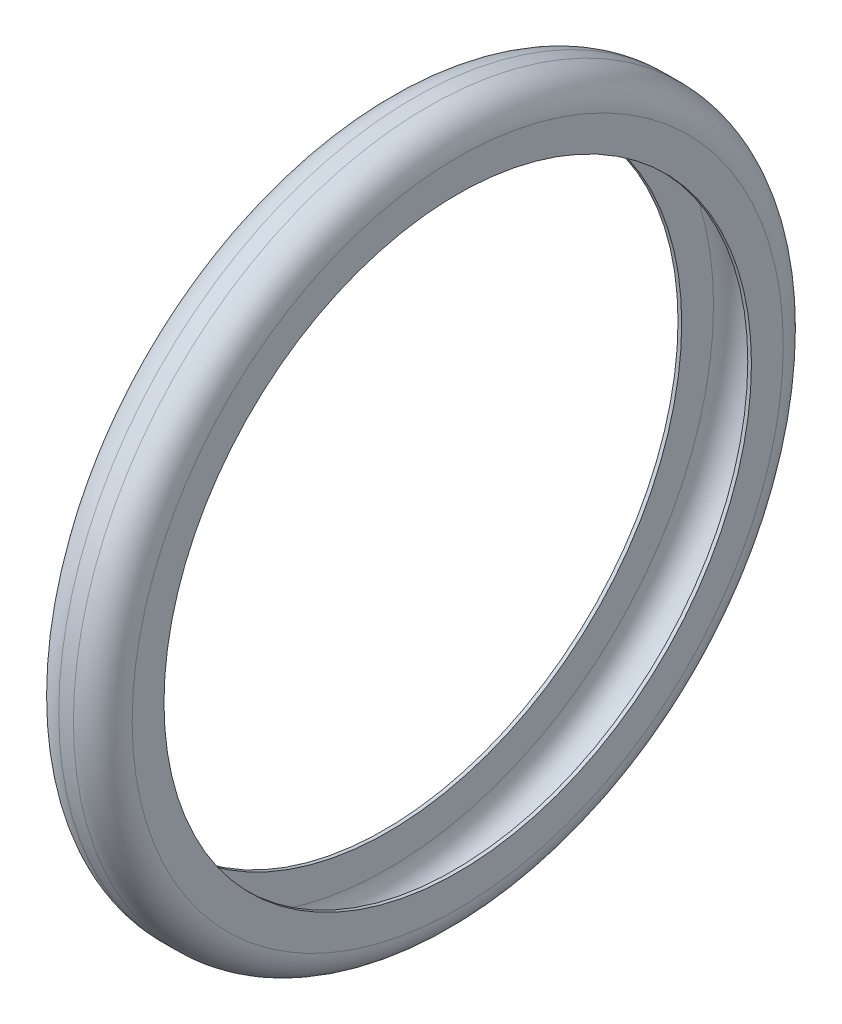
ISO-10303-21;
HEADER;
FILE_DESCRIPTION(('STEP AP214'),'2;1');
FILE_NAME('part.step','',(''),(''),'','','');
FILE_SCHEMA(('AUTOMOTIVE_DESIGN { 1 0 10303 214 1 1 1 1 }'));
ENDSEC;
DATA;
#1=APPLICATION_CONTEXT('core data for automotive mechanical design processes');
#2=APPLICATION_PROTOCOL_DEFINITION('international standard','automotive_design',2000,#1);
#3=PRODUCT_CONTEXT('',#1,'mechanical');
#4=PRODUCT('Part','Part','',(#3));
#5=PRODUCT_RELATED_PRODUCT_CATEGORY('part','',(#4));
#6=PRODUCT_DEFINITION_FORMATION('','',#4);
#7=PRODUCT_DEFINITION_CONTEXT('part definition',#1,'design');
#8=PRODUCT_DEFINITION('design','',#6,#7);
#9=PRODUCT_DEFINITION_SHAPE('','',#8);
#10=(LENGTH_UNIT() NAMED_UNIT(*) SI_UNIT(.MILLI.,.METRE.));
#11=(NAMED_UNIT(*) PLANE_ANGLE_UNIT() SI_UNIT($,.RADIAN.));
#12=(NAMED_UNIT(*) SI_UNIT($,.STERADIAN.) SOLID_ANGLE_UNIT());
#13=UNCERTAINTY_MEASURE_WITH_UNIT(LENGTH_MEASURE(1.E-05),#10,'distance_accuracy_value','');
#14=(GEOMETRIC_REPRESENTATION_CONTEXT(3) GLOBAL_UNCERTAINTY_ASSIGNED_CONTEXT((#13)) GLOBAL_UNIT_ASSIGNED_CONTEXT((#10,
#11,#12)) REPRESENTATION_CONTEXT('',''));
#15=CARTESIAN_POINT('',(0.,0.,0.));
#16=DIRECTION('',(0.,0.,1.));
#17=DIRECTION('',(1.,0.,0.));
#18=AXIS2_PLACEMENT_3D('',#15,#16,#17);
#19=CARTESIAN_POINT('',(60.,0.,0.));
#20=DIRECTION('',(-1.,0.,0.));
#21=DIRECTION('',(0.,0.,1.));
#22=AXIS2_PLACEMENT_3D('',#19,#20,#21);
#23=CYLINDRICAL_SURFACE('',#22,240.);
#24=CARTESIAN_POINT('',(0.,0.,0.));
#25=DIRECTION('',(1.,0.,0.));
#26=DIRECTION('',(0.,0.,-1.));
#27=AXIS2_PLACEMENT_3D('',#24,#25,#26);
#28=CIRCLE('',#27,240.);
#29=CARTESIAN_POINT('',(0.,0.,-240.));
#30=VERTEX_POINT('',#29);
#31=EDGE_CURVE('E55',#30,#30,#28,.T.);
#32=ORIENTED_EDGE('',*,*,#31,.F.);
#33=EDGE_LOOP('',(#32));
#34=FACE_BOUND('',#33,.T.);
#35=CARTESIAN_POINT('',(3.,0.,0.));
#36=DIRECTION('',(1.,0.,0.));
#37=DIRECTION('',(0.,0.,-1.));
#38=AXIS2_PLACEMENT_3D('',#35,#36,#37);
#39=CIRCLE('',#38,240.);
#40=CARTESIAN_POINT('',(3.,0.,-240.));
#41=VERTEX_POINT('',#40);
#42=EDGE_CURVE('E61',#41,#41,#39,.T.);
#43=ORIENTED_EDGE('',*,*,#42,.T.);
#44=EDGE_LOOP('',(#43));
#45=FACE_BOUND('',#44,.T.);
#46=ADVANCED_FACE('F34',(#34,#45),#23,.F.);
#47=CARTESIAN_POINT('',(60.,0.,0.));
#48=DIRECTION('',(1.,0.,0.));
#49=DIRECTION('',(0.,0.,-1.));
#50=AXIS2_PLACEMENT_3D('',#47,#48,#49);
#51=PLANE('',#50);
#52=CARTESIAN_POINT('',(60.,0.,0.));
#53=DIRECTION('',(1.,0.,0.));
#54=DIRECTION('',(0.,0.,-1.));
#55=AXIS2_PLACEMENT_3D('',#52,#53,#54);
#56=CIRCLE('',#55,266.);
#57=CARTESIAN_POINT('',(60.,0.,-266.));
#58=VERTEX_POINT('',#57);
#59=EDGE_CURVE('E10',#58,#58,#56,.T.);
#60=ORIENTED_EDGE('',*,*,#59,.T.);
#61=EDGE_LOOP('',(#60));
#62=FACE_BOUND('',#61,.T.);
#63=CARTESIAN_POINT('',(60.,0.,0.));
#64=DIRECTION('',(1.,0.,0.));
#65=DIRECTION('',(0.,0.,-1.));
#66=AXIS2_PLACEMENT_3D('',#63,#64,#65);
#67=CIRCLE('',#66,240.);
#68=CARTESIAN_POINT('',(60.,0.,-240.));
#69=VERTEX_POINT('',#68);
#70=EDGE_CURVE('E54',#69,#69,#67,.T.);
#71=ORIENTED_EDGE('',*,*,#70,.F.);
#72=EDGE_LOOP('',(#71));
#73=FACE_BOUND('',#72,.T.);
#74=ADVANCED_FACE('F96',(#62,#73),#51,.T.);
#75=CARTESIAN_POINT('',(0.,0.,0.));
#76=DIRECTION('',(1.,0.,0.));
#77=DIRECTION('',(0.,0.,-1.));
#78=AXIS2_PLACEMENT_3D('',#75,#76,#77);
#79=PLANE('',#78);
#80=CARTESIAN_POINT('',(0.,0.,0.));
#81=DIRECTION('',(1.,0.,0.));
#82=DIRECTION('',(0.,0.,-1.));
#83=AXIS2_PLACEMENT_3D('',#80,#81,#82);
#84=CIRCLE('',#83,266.);
#85=CARTESIAN_POINT('',(0.,0.,-266.));
#86=VERTEX_POINT('',#85);
#87=EDGE_CURVE('E41',#86,#86,#84,.F.);
#88=ORIENTED_EDGE('',*,*,#87,.T.);
#89=EDGE_LOOP('',(#88));
#90=FACE_BOUND('',#89,.T.);
#91=ORIENTED_EDGE('',*,*,#31,.T.);
#92=EDGE_LOOP('',(#91));
#93=FACE_BOUND('',#92,.T.);
#94=ADVANCED_FACE('F98',(#90,#93),#79,.F.);
#95=CARTESIAN_POINT('',(60.,0.,0.));
#96=DIRECTION('',(-1.,0.,0.));
#97=DIRECTION('',(0.,0.,1.));
#98=AXIS2_PLACEMENT_3D('',#95,#96,#97);
#99=CYLINDRICAL_SURFACE('',#98,290.);
#100=CARTESIAN_POINT('',(24.,0.,0.));
#101=DIRECTION('',(1.,0.,0.));
#102=DIRECTION('',(0.,0.,-1.));
#103=AXIS2_PLACEMENT_3D('',#100,#101,#102);
#104=CIRCLE('',#103,290.);
#105=CARTESIAN_POINT('',(24.,0.,-290.));
#106=VERTEX_POINT('',#105);
#107=EDGE_CURVE('E45',#106,#106,#104,.T.);
#108=ORIENTED_EDGE('',*,*,#107,.T.);
#109=EDGE_LOOP('',(#108));
#110=FACE_BOUND('',#109,.T.);
#111=CARTESIAN_POINT('',(36.,0.,0.));
#112=DIRECTION('',(1.,0.,0.));
#113=DIRECTION('',(0.,0.,-1.));
#114=AXIS2_PLACEMENT_3D('',#111,#112,#113);
#115=CIRCLE('',#114,290.);
#116=CARTESIAN_POINT('',(36.,0.,-290.));
#117=VERTEX_POINT('',#116);
#118=EDGE_CURVE('E49',#117,#117,#115,.F.);
#119=ORIENTED_EDGE('',*,*,#118,.T.);
#120=EDGE_LOOP('',(#119));
#121=FACE_BOUND('',#120,.T.);
#122=ADVANCED_FACE('F92',(#110,#121),#99,.T.);
#123=CARTESIAN_POINT('',(57.,0.,0.));
#124=DIRECTION('',(1.,0.,0.));
#125=DIRECTION('',(0.,0.,-1.));
#126=AXIS2_PLACEMENT_3D('',#123,#124,#125);
#127=CIRCLE('',#126,240.);
#128=CARTESIAN_POINT('',(57.,0.,-240.));
#129=VERTEX_POINT('',#128);
#130=EDGE_CURVE('E64',#129,#129,#127,.T.);
#131=ORIENTED_EDGE('',*,*,#130,.F.);
#132=EDGE_LOOP('',(#131));
#133=FACE_BOUND('',#132,.T.);
#134=ORIENTED_EDGE('',*,*,#70,.T.);
#135=EDGE_LOOP('',(#134));
#136=FACE_BOUND('',#135,.T.);
#137=ADVANCED_FACE('F88',(#133,#136),#23,.F.);
#138=CARTESIAN_POINT('',(24.,0.,0.));
#139=DIRECTION('',(1.,0.,0.));
#140=DIRECTION('',(0.,0.,-1.));
#141=AXIS2_PLACEMENT_3D('',#138,#139,#140);
#142=TOROIDAL_SURFACE('',#141,266.,24.);
#143=ORIENTED_EDGE('',*,*,#87,.F.);
#144=EDGE_LOOP('',(#143));
#145=FACE_BOUND('',#144,.T.);
#146=ORIENTED_EDGE('',*,*,#107,.F.);
#147=EDGE_LOOP('',(#146));
#148=FACE_BOUND('',#147,.T.);
#149=ADVANCED_FACE('F91',(#145,#148),#142,.T.);
#150=CARTESIAN_POINT('',(36.,0.,0.));
#151=DIRECTION('',(1.,0.,0.));
#152=DIRECTION('',(0.,0.,-1.));
#153=AXIS2_PLACEMENT_3D('',#150,#151,#152);
#154=TOROIDAL_SURFACE('',#153,266.,24.);
#155=ORIENTED_EDGE('',*,*,#118,.F.);
#156=EDGE_LOOP('',(#155));
#157=FACE_BOUND('',#156,.T.);
#158=ORIENTED_EDGE('',*,*,#59,.F.);
#159=EDGE_LOOP('',(#158));
#160=FACE_BOUND('',#159,.T.);
#161=ADVANCED_FACE('F36',(#157,#160),#154,.T.);
#162=CARTESIAN_POINT('',(57.,0.,0.));
#163=DIRECTION('',(1.,0.,0.));
#164=DIRECTION('',(0.,0.,-1.));
#165=AXIS2_PLACEMENT_3D('',#162,#163,#164);
#166=PLANE('',#165);
#167=CARTESIAN_POINT('',(57.,0.,0.));
#168=DIRECTION('',(1.,0.,0.));
#169=DIRECTION('',(0.,0.,-1.));
#170=AXIS2_PLACEMENT_3D('',#167,#168,#169);
#171=CIRCLE('',#170,266.);
#172=CARTESIAN_POINT('',(57.,0.,-266.));
#173=VERTEX_POINT('',#172);
#174=EDGE_CURVE('E58',#173,#173,#171,.T.);
#175=ORIENTED_EDGE('',*,*,#174,.F.);
#176=EDGE_LOOP('',(#175));
#177=FACE_BOUND('',#176,.T.);
#178=ORIENTED_EDGE('',*,*,#130,.T.);
#179=EDGE_LOOP('',(#178));
#180=FACE_BOUND('',#179,.T.);
#181=ADVANCED_FACE('F81',(#177,#180),#166,.F.);
#182=CARTESIAN_POINT('',(3.,0.,0.));
#183=DIRECTION('',(1.,0.,0.));
#184=DIRECTION('',(0.,0.,-1.));
#185=AXIS2_PLACEMENT_3D('',#182,#183,#184);
#186=PLANE('',#185);
#187=CARTESIAN_POINT('',(3.,0.,0.));
#188=DIRECTION('',(1.,0.,0.));
#189=DIRECTION('',(0.,0.,-1.));
#190=AXIS2_PLACEMENT_3D('',#187,#188,#189);
#191=CIRCLE('',#190,266.);
#192=CARTESIAN_POINT('',(3.,0.,-266.));
#193=VERTEX_POINT('',#192);
#194=EDGE_CURVE('E68',#193,#193,#191,.F.);
#195=ORIENTED_EDGE('',*,*,#194,.F.);
#196=EDGE_LOOP('',(#195));
#197=FACE_BOUND('',#196,.T.);
#198=ORIENTED_EDGE('',*,*,#42,.F.);
#199=EDGE_LOOP('',(#198));
#200=FACE_BOUND('',#199,.T.);
#201=ADVANCED_FACE('F84',(#197,#200),#186,.T.);
#202=CARTESIAN_POINT('',(60.,0.,0.));
#203=DIRECTION('',(-1.,0.,0.));
#204=DIRECTION('',(0.,0.,1.));
#205=AXIS2_PLACEMENT_3D('',#202,#203,#204);
#206=CYLINDRICAL_SURFACE('',#205,287.);
#207=CARTESIAN_POINT('',(24.,0.,0.));
#208=DIRECTION('',(-1.,0.,0.));
#209=DIRECTION('',(0.,0.,1.));
#210=AXIS2_PLACEMENT_3D('',#207,#208,#209);
#211=CIRCLE('',#210,287.);
#212=CARTESIAN_POINT('',(24.,0.,287.));
#213=VERTEX_POINT('',#212);
#214=EDGE_CURVE('E71',#213,#213,#211,.F.);
#215=ORIENTED_EDGE('',*,*,#214,.F.);
#216=EDGE_LOOP('',(#215));
#217=FACE_BOUND('',#216,.T.);
#218=CARTESIAN_POINT('',(36.,0.,0.));
#219=DIRECTION('',(-1.,0.,0.));
#220=DIRECTION('',(0.,0.,1.));
#221=AXIS2_PLACEMENT_3D('',#218,#219,#220);
#222=CIRCLE('',#221,287.);
#223=CARTESIAN_POINT('',(36.,0.,287.));
#224=VERTEX_POINT('',#223);
#225=EDGE_CURVE('E67',#224,#224,#222,.T.);
#226=ORIENTED_EDGE('',*,*,#225,.F.);
#227=EDGE_LOOP('',(#226));
#228=FACE_BOUND('',#227,.T.);
#229=ADVANCED_FACE('F135',(#217,#228),#206,.F.);
#230=CARTESIAN_POINT('',(24.,0.,0.));
#231=DIRECTION('',(1.,0.,0.));
#232=DIRECTION('',(0.,0.,-1.));
#233=AXIS2_PLACEMENT_3D('',#230,#231,#232);
#234=TOROIDAL_SURFACE('',#233,266.,21.);
#235=ORIENTED_EDGE('',*,*,#194,.T.);
#236=EDGE_LOOP('',(#235));
#237=FACE_BOUND('',#236,.T.);
#238=ORIENTED_EDGE('',*,*,#214,.T.);
#239=EDGE_LOOP('',(#238));
#240=FACE_BOUND('',#239,.T.);
#241=ADVANCED_FACE('F143',(#237,#240),#234,.F.);
#242=CARTESIAN_POINT('',(36.,0.,0.));
#243=DIRECTION('',(1.,0.,0.));
#244=DIRECTION('',(0.,0.,-1.));
#245=AXIS2_PLACEMENT_3D('',#242,#243,#244);
#246=TOROIDAL_SURFACE('',#245,266.,21.);
#247=ORIENTED_EDGE('',*,*,#225,.T.);
#248=EDGE_LOOP('',(#247));
#249=FACE_BOUND('',#248,.T.);
#250=ORIENTED_EDGE('',*,*,#174,.T.);
#251=EDGE_LOOP('',(#250));
#252=FACE_BOUND('',#251,.T.);
#253=ADVANCED_FACE('F79',(#249,#252),#246,.F.);
#254=CLOSED_SHELL('',(#46,#74,#94,#122,#137,#149,#161,#181,#201,#229,#241,#253));
#255=MANIFOLD_SOLID_BREP('B2',#254);
#256=ADVANCED_BREP_SHAPE_REPRESENTATION('',(#18,#255),#14);
#257=SHAPE_DEFINITION_REPRESENTATION(#9,#256);
ENDSEC;
END-ISO-10303-21;
